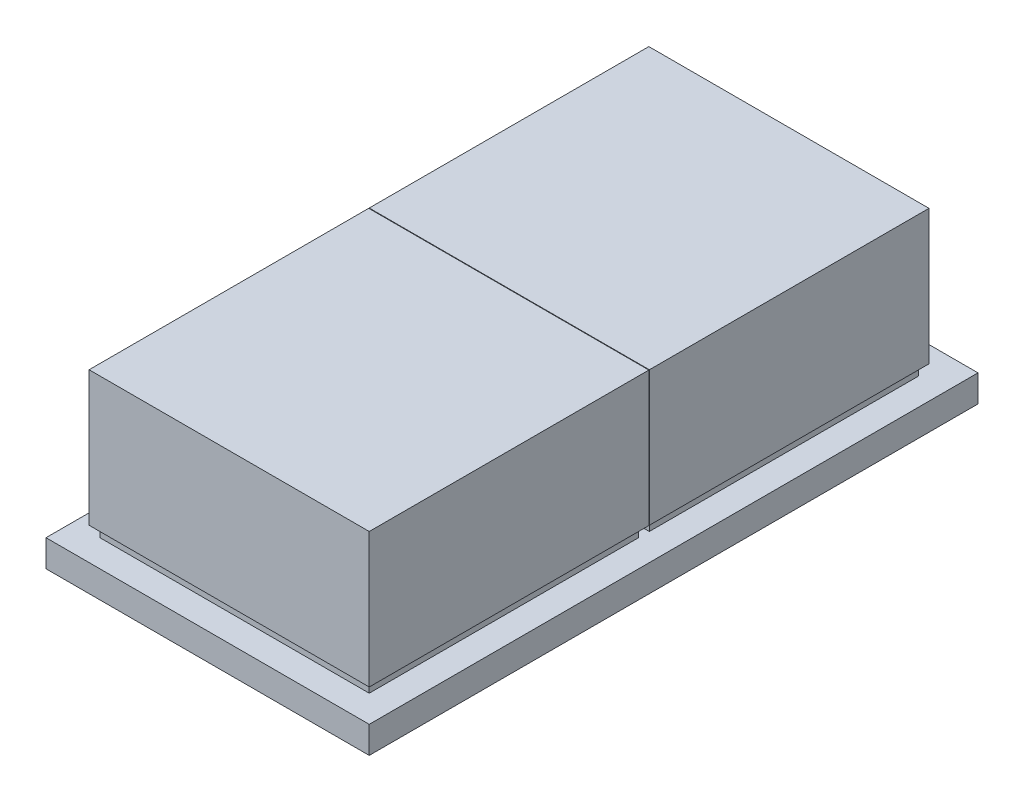
ISO-10303-21;
HEADER;
FILE_DESCRIPTION(('STEP AP214'),'2;1');
FILE_NAME('part.step','',(''),(''),'','','');
FILE_SCHEMA(('AUTOMOTIVE_DESIGN { 1 0 10303 214 1 1 1 1 }'));
ENDSEC;
DATA;
#1=APPLICATION_CONTEXT('core data for automotive mechanical design processes');
#2=APPLICATION_PROTOCOL_DEFINITION('international standard','automotive_design',2000,#1);
#3=PRODUCT_CONTEXT('',#1,'mechanical');
#4=PRODUCT('Part','Part','',(#3));
#5=PRODUCT_RELATED_PRODUCT_CATEGORY('part','',(#4));
#6=PRODUCT_DEFINITION_FORMATION('','',#4);
#7=PRODUCT_DEFINITION_CONTEXT('part definition',#1,'design');
#8=PRODUCT_DEFINITION('design','',#6,#7);
#9=PRODUCT_DEFINITION_SHAPE('','',#8);
#10=(LENGTH_UNIT() NAMED_UNIT(*) SI_UNIT(.MILLI.,.METRE.));
#11=(NAMED_UNIT(*) PLANE_ANGLE_UNIT() SI_UNIT($,.RADIAN.));
#12=(NAMED_UNIT(*) SI_UNIT($,.STERADIAN.) SOLID_ANGLE_UNIT());
#13=UNCERTAINTY_MEASURE_WITH_UNIT(LENGTH_MEASURE(1.E-05),#10,'distance_accuracy_value','');
#14=(GEOMETRIC_REPRESENTATION_CONTEXT(3) GLOBAL_UNCERTAINTY_ASSIGNED_CONTEXT((#13)) GLOBAL_UNIT_ASSIGNED_CONTEXT((#10,
#11,#12)) REPRESENTATION_CONTEXT('',''));
#15=CARTESIAN_POINT('',(0.,0.,0.));
#16=DIRECTION('',(0.,0.,1.));
#17=DIRECTION('',(1.,0.,0.));
#18=AXIS2_PLACEMENT_3D('',#15,#16,#17);
#19=CARTESIAN_POINT('',(0.,5.,0.));
#20=DIRECTION('',(0.,-1.,0.));
#21=DIRECTION('',(0.,0.,-1.));
#22=AXIS2_PLACEMENT_3D('',#19,#20,#21);
#23=PLANE('',#22);
#24=DIRECTION('',(0.,0.,-1.));
#25=VECTOR('',#24,1.);
#26=CARTESIAN_POINT('',(25.,5.,1.5));
#27=LINE('',#26,#25);
#28=CARTESIAN_POINT('',(25.,5.,51.5));
#29=VERTEX_POINT('',#28);
#30=CARTESIAN_POINT('',(25.,5.,1.5));
#31=VERTEX_POINT('',#30);
#32=EDGE_CURVE('E261',#29,#31,#27,.T.);
#33=ORIENTED_EDGE('',*,*,#32,.F.);
#34=DIRECTION('',(1.,0.,0.));
#35=VECTOR('',#34,1.);
#36=CARTESIAN_POINT('',(-25.,5.,51.5));
#37=LINE('',#36,#35);
#38=CARTESIAN_POINT('',(-25.,5.,51.5));
#39=VERTEX_POINT('',#38);
#40=EDGE_CURVE('E266',#39,#29,#37,.T.);
#41=ORIENTED_EDGE('',*,*,#40,.F.);
#42=DIRECTION('',(0.,0.,1.));
#43=VECTOR('',#42,1.);
#44=CARTESIAN_POINT('',(-25.,5.,1.5));
#45=LINE('',#44,#43);
#46=CARTESIAN_POINT('',(-25.,5.,1.5));
#47=VERTEX_POINT('',#46);
#48=EDGE_CURVE('E281',#47,#39,#45,.T.);
#49=ORIENTED_EDGE('',*,*,#48,.F.);
#50=DIRECTION('',(-1.,0.,0.));
#51=VECTOR('',#50,1.);
#52=CARTESIAN_POINT('',(-25.,5.,1.5));
#53=LINE('',#52,#51);
#54=EDGE_CURVE('E278',#31,#47,#53,.T.);
#55=ORIENTED_EDGE('',*,*,#54,.F.);
#56=EDGE_LOOP('',(#33,#41,#49,#55));
#57=FACE_BOUND('',#56,.T.);
#58=DIRECTION('',(0.,0.,-1.));
#59=VECTOR('',#58,1.);
#60=CARTESIAN_POINT('',(30.,5.,56.5));
#61=LINE('',#60,#59);
#62=CARTESIAN_POINT('',(30.,5.,56.5));
#63=VERTEX_POINT('',#62);
#64=CARTESIAN_POINT('',(30.,5.,-56.5));
#65=VERTEX_POINT('',#64);
#66=EDGE_CURVE('E298',#63,#65,#61,.T.);
#67=ORIENTED_EDGE('',*,*,#66,.T.);
#68=DIRECTION('',(-1.,0.,0.));
#69=VECTOR('',#68,1.);
#70=CARTESIAN_POINT('',(-30.,5.,-56.5));
#71=LINE('',#70,#69);
#72=CARTESIAN_POINT('',(-30.,5.,-56.5));
#73=VERTEX_POINT('',#72);
#74=EDGE_CURVE('E301',#65,#73,#71,.T.);
#75=ORIENTED_EDGE('',*,*,#74,.T.);
#76=DIRECTION('',(0.,0.,1.));
#77=VECTOR('',#76,1.);
#78=CARTESIAN_POINT('',(-30.,5.,56.5));
#79=LINE('',#78,#77);
#80=CARTESIAN_POINT('',(-30.,5.,56.5));
#81=VERTEX_POINT('',#80);
#82=EDGE_CURVE('E304',#73,#81,#79,.T.);
#83=ORIENTED_EDGE('',*,*,#82,.T.);
#84=DIRECTION('',(1.,0.,0.));
#85=VECTOR('',#84,1.);
#86=CARTESIAN_POINT('',(-30.,5.,56.5));
#87=LINE('',#86,#85);
#88=EDGE_CURVE('E306',#81,#63,#87,.T.);
#89=ORIENTED_EDGE('',*,*,#88,.T.);
#90=EDGE_LOOP('',(#67,#75,#83,#89));
#91=FACE_BOUND('',#90,.T.);
#92=DIRECTION('',(0.,0.,-1.));
#93=VECTOR('',#92,1.);
#94=CARTESIAN_POINT('',(25.,5.,-50.5));
#95=LINE('',#94,#93);
#96=CARTESIAN_POINT('',(25.,5.,-0.5));
#97=VERTEX_POINT('',#96);
#98=CARTESIAN_POINT('',(25.,5.,-50.5));
#99=VERTEX_POINT('',#98);
#100=EDGE_CURVE('E230',#97,#99,#95,.T.);
#101=ORIENTED_EDGE('',*,*,#100,.F.);
#102=DIRECTION('',(1.,0.,0.));
#103=VECTOR('',#102,1.);
#104=CARTESIAN_POINT('',(-25.,5.,-0.5));
#105=LINE('',#104,#103);
#106=CARTESIAN_POINT('',(-25.,5.,-0.5));
#107=VERTEX_POINT('',#106);
#108=EDGE_CURVE('E235',#107,#97,#105,.T.);
#109=ORIENTED_EDGE('',*,*,#108,.F.);
#110=DIRECTION('',(0.,0.,1.));
#111=VECTOR('',#110,1.);
#112=CARTESIAN_POINT('',(-25.,5.,-50.5));
#113=LINE('',#112,#111);
#114=CARTESIAN_POINT('',(-25.,5.,-50.5));
#115=VERTEX_POINT('',#114);
#116=EDGE_CURVE('E55',#115,#107,#113,.T.);
#117=ORIENTED_EDGE('',*,*,#116,.F.);
#118=DIRECTION('',(-1.,0.,0.));
#119=VECTOR('',#118,1.);
#120=CARTESIAN_POINT('',(-25.,5.,-50.5));
#121=LINE('',#120,#119);
#122=EDGE_CURVE('E50',#99,#115,#121,.T.);
#123=ORIENTED_EDGE('',*,*,#122,.F.);
#124=EDGE_LOOP('',(#101,#109,#117,#123));
#125=FACE_BOUND('',#124,.T.);
#126=ADVANCED_FACE('F35',(#57,#91,#125),#23,.F.);
#127=CARTESIAN_POINT('',(30.,5.,56.5));
#128=DIRECTION('',(-1.,0.,0.));
#129=DIRECTION('',(0.,0.,1.));
#130=AXIS2_PLACEMENT_3D('',#127,#128,#129);
#131=PLANE('',#130);
#132=DIRECTION('',(0.,0.,-1.));
#133=VECTOR('',#132,1.);
#134=CARTESIAN_POINT('',(30.,0.,56.5));
#135=LINE('',#134,#133);
#136=CARTESIAN_POINT('',(30.,0.,56.5));
#137=VERTEX_POINT('',#136);
#138=CARTESIAN_POINT('',(30.,0.,-56.5));
#139=VERTEX_POINT('',#138);
#140=EDGE_CURVE('E297',#137,#139,#135,.T.);
#141=ORIENTED_EDGE('',*,*,#140,.T.);
#142=DIRECTION('',(0.,-1.,0.));
#143=VECTOR('',#142,1.);
#144=CARTESIAN_POINT('',(30.,5.,-56.5));
#145=LINE('',#144,#143);
#146=EDGE_CURVE('E11',#65,#139,#145,.T.);
#147=ORIENTED_EDGE('',*,*,#146,.F.);
#148=ORIENTED_EDGE('',*,*,#66,.F.);
#149=DIRECTION('',(0.,-1.,0.));
#150=VECTOR('',#149,1.);
#151=CARTESIAN_POINT('',(30.,5.,56.5));
#152=LINE('',#151,#150);
#153=EDGE_CURVE('E308',#63,#137,#152,.T.);
#154=ORIENTED_EDGE('',*,*,#153,.T.);
#155=EDGE_LOOP('',(#141,#147,#148,#154));
#156=FACE_BOUND('',#155,.T.);
#157=ADVANCED_FACE('F37',(#156),#131,.F.);
#158=CARTESIAN_POINT('',(-30.,5.,-56.5));
#159=DIRECTION('',(0.,0.,1.));
#160=DIRECTION('',(1.,0.,0.));
#161=AXIS2_PLACEMENT_3D('',#158,#159,#160);
#162=PLANE('',#161);
#163=DIRECTION('',(-1.,0.,0.));
#164=VECTOR('',#163,1.);
#165=CARTESIAN_POINT('',(-30.,0.,-56.5));
#166=LINE('',#165,#164);
#167=CARTESIAN_POINT('',(-30.,0.,-56.5));
#168=VERTEX_POINT('',#167);
#169=EDGE_CURVE('E311',#139,#168,#166,.T.);
#170=ORIENTED_EDGE('',*,*,#169,.T.);
#171=DIRECTION('',(0.,-1.,0.));
#172=VECTOR('',#171,1.);
#173=CARTESIAN_POINT('',(-30.,5.,-56.5));
#174=LINE('',#173,#172);
#175=EDGE_CURVE('E43',#73,#168,#174,.T.);
#176=ORIENTED_EDGE('',*,*,#175,.F.);
#177=ORIENTED_EDGE('',*,*,#74,.F.);
#178=ORIENTED_EDGE('',*,*,#146,.T.);
#179=EDGE_LOOP('',(#170,#176,#177,#178));
#180=FACE_BOUND('',#179,.T.);
#181=ADVANCED_FACE('F340',(#180),#162,.F.);
#182=CARTESIAN_POINT('',(-30.,5.,56.5));
#183=DIRECTION('',(1.,0.,0.));
#184=DIRECTION('',(0.,0.,-1.));
#185=AXIS2_PLACEMENT_3D('',#182,#183,#184);
#186=PLANE('',#185);
#187=DIRECTION('',(0.,0.,1.));
#188=VECTOR('',#187,1.);
#189=CARTESIAN_POINT('',(-30.,0.,56.5));
#190=LINE('',#189,#188);
#191=CARTESIAN_POINT('',(-30.,0.,56.5));
#192=VERTEX_POINT('',#191);
#193=EDGE_CURVE('E313',#168,#192,#190,.T.);
#194=ORIENTED_EDGE('',*,*,#193,.T.);
#195=DIRECTION('',(0.,-1.,0.));
#196=VECTOR('',#195,1.);
#197=CARTESIAN_POINT('',(-30.,5.,56.5));
#198=LINE('',#197,#196);
#199=EDGE_CURVE('E318',#81,#192,#198,.T.);
#200=ORIENTED_EDGE('',*,*,#199,.F.);
#201=ORIENTED_EDGE('',*,*,#82,.F.);
#202=ORIENTED_EDGE('',*,*,#175,.T.);
#203=EDGE_LOOP('',(#194,#200,#201,#202));
#204=FACE_BOUND('',#203,.T.);
#205=ADVANCED_FACE('F325',(#204),#186,.F.);
#206=CARTESIAN_POINT('',(-30.,5.,56.5));
#207=DIRECTION('',(0.,0.,-1.));
#208=DIRECTION('',(-1.,0.,0.));
#209=AXIS2_PLACEMENT_3D('',#206,#207,#208);
#210=PLANE('',#209);
#211=DIRECTION('',(1.,0.,0.));
#212=VECTOR('',#211,1.);
#213=CARTESIAN_POINT('',(-30.,0.,56.5));
#214=LINE('',#213,#212);
#215=EDGE_CURVE('E302',#192,#137,#214,.T.);
#216=ORIENTED_EDGE('',*,*,#215,.T.);
#217=ORIENTED_EDGE('',*,*,#153,.F.);
#218=ORIENTED_EDGE('',*,*,#88,.F.);
#219=ORIENTED_EDGE('',*,*,#199,.T.);
#220=EDGE_LOOP('',(#216,#217,#218,#219));
#221=FACE_BOUND('',#220,.T.);
#222=ADVANCED_FACE('F334',(#221),#210,.F.);
#223=CARTESIAN_POINT('',(0.,0.,0.));
#224=DIRECTION('',(0.,-1.,0.));
#225=DIRECTION('',(0.,0.,-1.));
#226=AXIS2_PLACEMENT_3D('',#223,#224,#225);
#227=PLANE('',#226);
#228=ORIENTED_EDGE('',*,*,#140,.F.);
#229=ORIENTED_EDGE('',*,*,#215,.F.);
#230=ORIENTED_EDGE('',*,*,#193,.F.);
#231=ORIENTED_EDGE('',*,*,#169,.F.);
#232=EDGE_LOOP('',(#228,#229,#230,#231));
#233=FACE_BOUND('',#232,.T.);
#234=ADVANCED_FACE('F331',(#233),#227,.T.);
#235=CARTESIAN_POINT('',(25.,7.,1.5));
#236=DIRECTION('',(-1.,0.,0.));
#237=DIRECTION('',(0.,0.,1.));
#238=AXIS2_PLACEMENT_3D('',#235,#236,#237);
#239=PLANE('',#238);
#240=ORIENTED_EDGE('',*,*,#32,.T.);
#241=DIRECTION('',(0.,-1.,0.));
#242=VECTOR('',#241,1.);
#243=CARTESIAN_POINT('',(25.,7.,1.5));
#244=LINE('',#243,#242);
#245=CARTESIAN_POINT('',(25.,7.,1.5));
#246=VERTEX_POINT('',#245);
#247=EDGE_CURVE('E294',#246,#31,#244,.T.);
#248=ORIENTED_EDGE('',*,*,#247,.F.);
#249=DIRECTION('',(0.,0.,-1.));
#250=VECTOR('',#249,1.);
#251=CARTESIAN_POINT('',(25.,7.,1.5));
#252=LINE('',#251,#250);
#253=CARTESIAN_POINT('',(25.,7.,51.5));
#254=VERTEX_POINT('',#253);
#255=EDGE_CURVE('E262',#254,#246,#252,.T.);
#256=ORIENTED_EDGE('',*,*,#255,.F.);
#257=DIRECTION('',(0.,-1.,0.));
#258=VECTOR('',#257,1.);
#259=CARTESIAN_POINT('',(25.,7.,51.5));
#260=LINE('',#259,#258);
#261=EDGE_CURVE('E275',#254,#29,#260,.T.);
#262=ORIENTED_EDGE('',*,*,#261,.T.);
#263=EDGE_LOOP('',(#240,#248,#256,#262));
#264=FACE_BOUND('',#263,.T.);
#265=ADVANCED_FACE('F354',(#264),#239,.F.);
#266=CARTESIAN_POINT('',(-25.,7.,1.5));
#267=DIRECTION('',(0.,0.,1.));
#268=DIRECTION('',(1.,0.,0.));
#269=AXIS2_PLACEMENT_3D('',#266,#267,#268);
#270=PLANE('',#269);
#271=ORIENTED_EDGE('',*,*,#54,.T.);
#272=DIRECTION('',(0.,-1.,0.));
#273=VECTOR('',#272,1.);
#274=CARTESIAN_POINT('',(-25.,7.,1.5));
#275=LINE('',#274,#273);
#276=CARTESIAN_POINT('',(-25.,7.,1.5));
#277=VERTEX_POINT('',#276);
#278=EDGE_CURVE('E291',#277,#47,#275,.T.);
#279=ORIENTED_EDGE('',*,*,#278,.F.);
#280=DIRECTION('',(-1.,0.,0.));
#281=VECTOR('',#280,1.);
#282=CARTESIAN_POINT('',(-25.,7.,1.5));
#283=LINE('',#282,#281);
#284=EDGE_CURVE('E265',#246,#277,#283,.T.);
#285=ORIENTED_EDGE('',*,*,#284,.F.);
#286=ORIENTED_EDGE('',*,*,#247,.T.);
#287=EDGE_LOOP('',(#271,#279,#285,#286));
#288=FACE_BOUND('',#287,.T.);
#289=ADVANCED_FACE('F373',(#288),#270,.F.);
#290=CARTESIAN_POINT('',(-25.,7.,1.5));
#291=DIRECTION('',(1.,0.,0.));
#292=DIRECTION('',(0.,0.,-1.));
#293=AXIS2_PLACEMENT_3D('',#290,#291,#292);
#294=PLANE('',#293);
#295=ORIENTED_EDGE('',*,*,#48,.T.);
#296=DIRECTION('',(0.,-1.,0.));
#297=VECTOR('',#296,1.);
#298=CARTESIAN_POINT('',(-25.,7.,51.5));
#299=LINE('',#298,#297);
#300=CARTESIAN_POINT('',(-25.,7.,51.5));
#301=VERTEX_POINT('',#300);
#302=EDGE_CURVE('E288',#301,#39,#299,.T.);
#303=ORIENTED_EDGE('',*,*,#302,.F.);
#304=DIRECTION('',(0.,0.,1.));
#305=VECTOR('',#304,1.);
#306=CARTESIAN_POINT('',(-25.,7.,1.5));
#307=LINE('',#306,#305);
#308=EDGE_CURVE('E269',#277,#301,#307,.T.);
#309=ORIENTED_EDGE('',*,*,#308,.F.);
#310=ORIENTED_EDGE('',*,*,#278,.T.);
#311=EDGE_LOOP('',(#295,#303,#309,#310));
#312=FACE_BOUND('',#311,.T.);
#313=ADVANCED_FACE('F380',(#312),#294,.F.);
#314=CARTESIAN_POINT('',(-25.,7.,51.5));
#315=DIRECTION('',(0.,0.,-1.));
#316=DIRECTION('',(-1.,0.,0.));
#317=AXIS2_PLACEMENT_3D('',#314,#315,#316);
#318=PLANE('',#317);
#319=ORIENTED_EDGE('',*,*,#40,.T.);
#320=ORIENTED_EDGE('',*,*,#261,.F.);
#321=DIRECTION('',(1.,0.,0.));
#322=VECTOR('',#321,1.);
#323=CARTESIAN_POINT('',(-25.,7.,51.5));
#324=LINE('',#323,#322);
#325=EDGE_CURVE('E272',#301,#254,#324,.T.);
#326=ORIENTED_EDGE('',*,*,#325,.F.);
#327=ORIENTED_EDGE('',*,*,#302,.T.);
#328=EDGE_LOOP('',(#319,#320,#326,#327));
#329=FACE_BOUND('',#328,.T.);
#330=ADVANCED_FACE('F387',(#329),#318,.F.);
#331=CARTESIAN_POINT('',(25.,7.,-50.5));
#332=DIRECTION('',(-1.,0.,0.));
#333=DIRECTION('',(0.,0.,1.));
#334=AXIS2_PLACEMENT_3D('',#331,#332,#333);
#335=PLANE('',#334);
#336=ORIENTED_EDGE('',*,*,#100,.T.);
#337=DIRECTION('',(0.,-1.,0.));
#338=VECTOR('',#337,1.);
#339=CARTESIAN_POINT('',(25.,7.,-50.5));
#340=LINE('',#339,#338);
#341=CARTESIAN_POINT('',(25.,7.,-50.5));
#342=VERTEX_POINT('',#341);
#343=EDGE_CURVE('E259',#342,#99,#340,.T.);
#344=ORIENTED_EDGE('',*,*,#343,.F.);
#345=DIRECTION('',(0.,0.,-1.));
#346=VECTOR('',#345,1.);
#347=CARTESIAN_POINT('',(25.,7.,-50.5));
#348=LINE('',#347,#346);
#349=CARTESIAN_POINT('',(25.,7.,-0.5));
#350=VERTEX_POINT('',#349);
#351=EDGE_CURVE('E231',#350,#342,#348,.T.);
#352=ORIENTED_EDGE('',*,*,#351,.F.);
#353=DIRECTION('',(0.,-1.,0.));
#354=VECTOR('',#353,1.);
#355=CARTESIAN_POINT('',(25.,7.,-0.5));
#356=LINE('',#355,#354);
#357=EDGE_CURVE('E244',#350,#97,#356,.T.);
#358=ORIENTED_EDGE('',*,*,#357,.T.);
#359=EDGE_LOOP('',(#336,#344,#352,#358));
#360=FACE_BOUND('',#359,.T.);
#361=ADVANCED_FACE('F395',(#360),#335,.F.);
#362=CARTESIAN_POINT('',(-25.,7.,-50.5));
#363=DIRECTION('',(0.,0.,1.));
#364=DIRECTION('',(1.,0.,0.));
#365=AXIS2_PLACEMENT_3D('',#362,#363,#364);
#366=PLANE('',#365);
#367=ORIENTED_EDGE('',*,*,#122,.T.);
#368=DIRECTION('',(0.,-1.,0.));
#369=VECTOR('',#368,1.);
#370=CARTESIAN_POINT('',(-25.,7.,-50.5));
#371=LINE('',#370,#369);
#372=CARTESIAN_POINT('',(-25.,7.,-50.5));
#373=VERTEX_POINT('',#372);
#374=EDGE_CURVE('E256',#373,#115,#371,.T.);
#375=ORIENTED_EDGE('',*,*,#374,.F.);
#376=DIRECTION('',(-1.,0.,0.));
#377=VECTOR('',#376,1.);
#378=CARTESIAN_POINT('',(-25.,7.,-50.5));
#379=LINE('',#378,#377);
#380=EDGE_CURVE('E234',#342,#373,#379,.T.);
#381=ORIENTED_EDGE('',*,*,#380,.F.);
#382=ORIENTED_EDGE('',*,*,#343,.T.);
#383=EDGE_LOOP('',(#367,#375,#381,#382));
#384=FACE_BOUND('',#383,.T.);
#385=ADVANCED_FACE('F404',(#384),#366,.F.);
#386=CARTESIAN_POINT('',(-25.,7.,-50.5));
#387=DIRECTION('',(1.,0.,0.));
#388=DIRECTION('',(0.,0.,-1.));
#389=AXIS2_PLACEMENT_3D('',#386,#387,#388);
#390=PLANE('',#389);
#391=ORIENTED_EDGE('',*,*,#116,.T.);
#392=DIRECTION('',(0.,-1.,0.));
#393=VECTOR('',#392,1.);
#394=CARTESIAN_POINT('',(-25.,7.,-0.5));
#395=LINE('',#394,#393);
#396=CARTESIAN_POINT('',(-25.,7.,-0.5));
#397=VERTEX_POINT('',#396);
#398=EDGE_CURVE('E253',#397,#107,#395,.T.);
#399=ORIENTED_EDGE('',*,*,#398,.F.);
#400=DIRECTION('',(0.,0.,1.));
#401=VECTOR('',#400,1.);
#402=CARTESIAN_POINT('',(-25.,7.,-50.5));
#403=LINE('',#402,#401);
#404=EDGE_CURVE('E238',#373,#397,#403,.T.);
#405=ORIENTED_EDGE('',*,*,#404,.F.);
#406=ORIENTED_EDGE('',*,*,#374,.T.);
#407=EDGE_LOOP('',(#391,#399,#405,#406));
#408=FACE_BOUND('',#407,.T.);
#409=ADVANCED_FACE('F414',(#408),#390,.F.);
#410=CARTESIAN_POINT('',(-25.,7.,-0.5));
#411=DIRECTION('',(0.,0.,-1.));
#412=DIRECTION('',(-1.,0.,0.));
#413=AXIS2_PLACEMENT_3D('',#410,#411,#412);
#414=PLANE('',#413);
#415=ORIENTED_EDGE('',*,*,#108,.T.);
#416=ORIENTED_EDGE('',*,*,#357,.F.);
#417=DIRECTION('',(1.,0.,0.));
#418=VECTOR('',#417,1.);
#419=CARTESIAN_POINT('',(-25.,7.,-0.5));
#420=LINE('',#419,#418);
#421=EDGE_CURVE('E241',#397,#350,#420,.T.);
#422=ORIENTED_EDGE('',*,*,#421,.F.);
#423=ORIENTED_EDGE('',*,*,#398,.T.);
#424=EDGE_LOOP('',(#415,#416,#422,#423));
#425=FACE_BOUND('',#424,.T.);
#426=ADVANCED_FACE('F423',(#425),#414,.F.);
#427=CARTESIAN_POINT('',(0.,7.,0.));
#428=DIRECTION('',(0.,1.,0.));
#429=DIRECTION('',(0.,0.,1.));
#430=AXIS2_PLACEMENT_3D('',#427,#428,#429);
#431=PLANE('',#430);
#432=DIRECTION('',(0.,0.,-1.));
#433=VECTOR('',#432,1.);
#434=CARTESIAN_POINT('',(26.,7.,0.600000000000003));
#435=LINE('',#434,#433);
#436=CARTESIAN_POINT('',(26.,7.,52.5));
#437=VERTEX_POINT('',#436);
#438=CARTESIAN_POINT('',(26.,7.,0.600000000000003));
#439=VERTEX_POINT('',#438);
#440=EDGE_CURVE('E195',#437,#439,#435,.T.);
#441=ORIENTED_EDGE('',*,*,#440,.F.);
#442=DIRECTION('',(1.,0.,0.));
#443=VECTOR('',#442,1.);
#444=CARTESIAN_POINT('',(-26.,7.,52.5));
#445=LINE('',#444,#443);
#446=CARTESIAN_POINT('',(-26.,7.,52.5));
#447=VERTEX_POINT('',#446);
#448=EDGE_CURVE('E208',#447,#437,#445,.T.);
#449=ORIENTED_EDGE('',*,*,#448,.F.);
#450=DIRECTION('',(0.,0.,1.));
#451=VECTOR('',#450,1.);
#452=CARTESIAN_POINT('',(-26.,7.,0.600000000000003));
#453=LINE('',#452,#451);
#454=CARTESIAN_POINT('',(-26.,7.,0.600000000000003));
#455=VERTEX_POINT('',#454);
#456=EDGE_CURVE('E216',#455,#447,#453,.T.);
#457=ORIENTED_EDGE('',*,*,#456,.F.);
#458=DIRECTION('',(-1.,0.,0.));
#459=VECTOR('',#458,1.);
#460=CARTESIAN_POINT('',(-26.,7.,0.600000000000003));
#461=LINE('',#460,#459);
#462=EDGE_CURVE('E198',#439,#455,#461,.T.);
#463=ORIENTED_EDGE('',*,*,#462,.F.);
#464=EDGE_LOOP('',(#441,#449,#457,#463));
#465=FACE_BOUND('',#464,.T.);
#466=ORIENTED_EDGE('',*,*,#325,.T.);
#467=ORIENTED_EDGE('',*,*,#255,.T.);
#468=ORIENTED_EDGE('',*,*,#284,.T.);
#469=ORIENTED_EDGE('',*,*,#308,.T.);
#470=EDGE_LOOP('',(#466,#467,#468,#469));
#471=FACE_BOUND('',#470,.T.);
#472=ADVANCED_FACE('F432',(#465,#471),#431,.F.);
#473=CARTESIAN_POINT('',(26.,32.,0.600000000000003));
#474=DIRECTION('',(-1.,0.,0.));
#475=DIRECTION('',(0.,0.,1.));
#476=AXIS2_PLACEMENT_3D('',#473,#474,#475);
#477=PLANE('',#476);
#478=ORIENTED_EDGE('',*,*,#440,.T.);
#479=DIRECTION('',(0.,-1.,0.));
#480=VECTOR('',#479,1.);
#481=CARTESIAN_POINT('',(26.,32.,0.600000000000003));
#482=LINE('',#481,#480);
#483=CARTESIAN_POINT('',(26.,32.,0.600000000000003));
#484=VERTEX_POINT('',#483);
#485=EDGE_CURVE('E227',#484,#439,#482,.T.);
#486=ORIENTED_EDGE('',*,*,#485,.F.);
#487=DIRECTION('',(0.,0.,-1.));
#488=VECTOR('',#487,1.);
#489=CARTESIAN_POINT('',(26.,32.,0.600000000000003));
#490=LINE('',#489,#488);
#491=CARTESIAN_POINT('',(26.,32.,52.5));
#492=VERTEX_POINT('',#491);
#493=EDGE_CURVE('E204',#492,#484,#490,.T.);
#494=ORIENTED_EDGE('',*,*,#493,.F.);
#495=DIRECTION('',(0.,-1.,0.));
#496=VECTOR('',#495,1.);
#497=CARTESIAN_POINT('',(26.,32.,52.5));
#498=LINE('',#497,#496);
#499=EDGE_CURVE('E213',#492,#437,#498,.T.);
#500=ORIENTED_EDGE('',*,*,#499,.T.);
#501=EDGE_LOOP('',(#478,#486,#494,#500));
#502=FACE_BOUND('',#501,.T.);
#503=ADVANCED_FACE('F441',(#502),#477,.F.);
#504=CARTESIAN_POINT('',(-26.,32.,0.600000000000003));
#505=DIRECTION('',(0.,0.,1.));
#506=DIRECTION('',(1.,0.,0.));
#507=AXIS2_PLACEMENT_3D('',#504,#505,#506);
#508=PLANE('',#507);
#509=ORIENTED_EDGE('',*,*,#462,.T.);
#510=DIRECTION('',(0.,-1.,0.));
#511=VECTOR('',#510,1.);
#512=CARTESIAN_POINT('',(-26.,32.,0.600000000000003));
#513=LINE('',#512,#511);
#514=CARTESIAN_POINT('',(-26.,32.,0.600000000000003));
#515=VERTEX_POINT('',#514);
#516=EDGE_CURVE('E224',#515,#455,#513,.T.);
#517=ORIENTED_EDGE('',*,*,#516,.F.);
#518=DIRECTION('',(-1.,0.,0.));
#519=VECTOR('',#518,1.);
#520=CARTESIAN_POINT('',(-26.,32.,0.600000000000003));
#521=LINE('',#520,#519);
#522=EDGE_CURVE('E207',#484,#515,#521,.T.);
#523=ORIENTED_EDGE('',*,*,#522,.F.);
#524=ORIENTED_EDGE('',*,*,#485,.T.);
#525=EDGE_LOOP('',(#509,#517,#523,#524));
#526=FACE_BOUND('',#525,.T.);
#527=ADVANCED_FACE('F449',(#526),#508,.F.);
#528=CARTESIAN_POINT('',(-26.,32.,0.600000000000003));
#529=DIRECTION('',(1.,0.,0.));
#530=DIRECTION('',(0.,0.,-1.));
#531=AXIS2_PLACEMENT_3D('',#528,#529,#530);
#532=PLANE('',#531);
#533=ORIENTED_EDGE('',*,*,#456,.T.);
#534=DIRECTION('',(0.,-1.,0.));
#535=VECTOR('',#534,1.);
#536=CARTESIAN_POINT('',(-26.,32.,52.5));
#537=LINE('',#536,#535);
#538=CARTESIAN_POINT('',(-26.,32.,52.5));
#539=VERTEX_POINT('',#538);
#540=EDGE_CURVE('E221',#539,#447,#537,.T.);
#541=ORIENTED_EDGE('',*,*,#540,.F.);
#542=DIRECTION('',(0.,0.,1.));
#543=VECTOR('',#542,1.);
#544=CARTESIAN_POINT('',(-26.,32.,0.600000000000003));
#545=LINE('',#544,#543);
#546=EDGE_CURVE('E210',#515,#539,#545,.T.);
#547=ORIENTED_EDGE('',*,*,#546,.F.);
#548=ORIENTED_EDGE('',*,*,#516,.T.);
#549=EDGE_LOOP('',(#533,#541,#547,#548));
#550=FACE_BOUND('',#549,.T.);
#551=ADVANCED_FACE('F457',(#550),#532,.F.);
#552=CARTESIAN_POINT('',(-26.,32.,52.5));
#553=DIRECTION('',(0.,0.,-1.));
#554=DIRECTION('',(-1.,0.,0.));
#555=AXIS2_PLACEMENT_3D('',#552,#553,#554);
#556=PLANE('',#555);
#557=ORIENTED_EDGE('',*,*,#448,.T.);
#558=ORIENTED_EDGE('',*,*,#499,.F.);
#559=DIRECTION('',(1.,0.,0.));
#560=VECTOR('',#559,1.);
#561=CARTESIAN_POINT('',(-26.,32.,52.5));
#562=LINE('',#561,#560);
#563=EDGE_CURVE('E212',#539,#492,#562,.T.);
#564=ORIENTED_EDGE('',*,*,#563,.F.);
#565=ORIENTED_EDGE('',*,*,#540,.T.);
#566=EDGE_LOOP('',(#557,#558,#564,#565));
#567=FACE_BOUND('',#566,.T.);
#568=ADVANCED_FACE('F465',(#567),#556,.F.);
#569=CARTESIAN_POINT('',(0.,32.,0.));
#570=DIRECTION('',(0.,1.,0.));
#571=DIRECTION('',(0.,0.,1.));
#572=AXIS2_PLACEMENT_3D('',#569,#570,#571);
#573=PLANE('',#572);
#574=ORIENTED_EDGE('',*,*,#493,.T.);
#575=ORIENTED_EDGE('',*,*,#522,.T.);
#576=ORIENTED_EDGE('',*,*,#546,.T.);
#577=ORIENTED_EDGE('',*,*,#563,.T.);
#578=EDGE_LOOP('',(#574,#575,#576,#577));
#579=FACE_BOUND('',#578,.T.);
#580=ADVANCED_FACE('F473',(#579),#573,.T.);
#581=CARTESIAN_POINT('',(0.,7.,-52.));
#582=DIRECTION('',(0.,1.,0.));
#583=DIRECTION('',(0.,0.,1.));
#584=AXIS2_PLACEMENT_3D('',#581,#582,#583);
#585=PLANE('',#584);
#586=DIRECTION('',(0.,0.,-1.));
#587=VECTOR('',#586,1.);
#588=CARTESIAN_POINT('',(26.,7.,-51.4));
#589=LINE('',#588,#587);
#590=CARTESIAN_POINT('',(26.,7.,0.5));
#591=VERTEX_POINT('',#590);
#592=CARTESIAN_POINT('',(26.,7.,-51.4));
#593=VERTEX_POINT('',#592);
#594=EDGE_CURVE('E194',#591,#593,#589,.T.);
#595=ORIENTED_EDGE('',*,*,#594,.F.);
#596=DIRECTION('',(1.,0.,0.));
#597=VECTOR('',#596,1.);
#598=CARTESIAN_POINT('',(-26.,7.,0.5));
#599=LINE('',#598,#597);
#600=CARTESIAN_POINT('',(-26.,7.,0.5));
#601=VERTEX_POINT('',#600);
#602=EDGE_CURVE('E190',#601,#591,#599,.T.);
#603=ORIENTED_EDGE('',*,*,#602,.F.);
#604=DIRECTION('',(0.,0.,1.));
#605=VECTOR('',#604,1.);
#606=CARTESIAN_POINT('',(-26.,7.,-51.4));
#607=LINE('',#606,#605);
#608=CARTESIAN_POINT('',(-26.,7.,-51.4));
#609=VERTEX_POINT('',#608);
#610=EDGE_CURVE('E608',#609,#601,#607,.T.);
#611=ORIENTED_EDGE('',*,*,#610,.F.);
#612=DIRECTION('',(-1.,0.,0.));
#613=VECTOR('',#612,1.);
#614=CARTESIAN_POINT('',(-26.,7.,-51.4));
#615=LINE('',#614,#613);
#616=EDGE_CURVE('E612',#593,#609,#615,.T.);
#617=ORIENTED_EDGE('',*,*,#616,.F.);
#618=EDGE_LOOP('',(#595,#603,#611,#617));
#619=FACE_BOUND('',#618,.T.);
#620=ORIENTED_EDGE('',*,*,#421,.T.);
#621=ORIENTED_EDGE('',*,*,#351,.T.);
#622=ORIENTED_EDGE('',*,*,#380,.T.);
#623=ORIENTED_EDGE('',*,*,#404,.T.);
#624=EDGE_LOOP('',(#620,#621,#622,#623));
#625=FACE_BOUND('',#624,.T.);
#626=ADVANCED_FACE('F481',(#619,#625),#585,.F.);
#627=CARTESIAN_POINT('',(26.,32.,-51.4));
#628=DIRECTION('',(-1.,0.,0.));
#629=DIRECTION('',(0.,0.,1.));
#630=AXIS2_PLACEMENT_3D('',#627,#628,#629);
#631=PLANE('',#630);
#632=ORIENTED_EDGE('',*,*,#594,.T.);
#633=DIRECTION('',(0.,-1.,0.));
#634=VECTOR('',#633,1.);
#635=CARTESIAN_POINT('',(26.,32.,-51.4));
#636=LINE('',#635,#634);
#637=CARTESIAN_POINT('',(26.,32.,-51.4));
#638=VERTEX_POINT('',#637);
#639=EDGE_CURVE('E174',#638,#593,#636,.T.);
#640=ORIENTED_EDGE('',*,*,#639,.F.);
#641=DIRECTION('',(0.,0.,-1.));
#642=VECTOR('',#641,1.);
#643=CARTESIAN_POINT('',(26.,32.,-51.4));
#644=LINE('',#643,#642);
#645=CARTESIAN_POINT('',(26.,32.,0.5));
#646=VERTEX_POINT('',#645);
#647=EDGE_CURVE('E181',#646,#638,#644,.T.);
#648=ORIENTED_EDGE('',*,*,#647,.F.);
#649=DIRECTION('',(0.,-1.,0.));
#650=VECTOR('',#649,1.);
#651=CARTESIAN_POINT('',(26.,32.,0.5));
#652=LINE('',#651,#650);
#653=EDGE_CURVE('E605',#646,#591,#652,.T.);
#654=ORIENTED_EDGE('',*,*,#653,.T.);
#655=EDGE_LOOP('',(#632,#640,#648,#654));
#656=FACE_BOUND('',#655,.T.);
#657=ADVANCED_FACE('F192',(#656),#631,.F.);
#658=CARTESIAN_POINT('',(-26.,32.,-51.4));
#659=DIRECTION('',(0.,0.,1.));
#660=DIRECTION('',(1.,0.,0.));
#661=AXIS2_PLACEMENT_3D('',#658,#659,#660);
#662=PLANE('',#661);
#663=ORIENTED_EDGE('',*,*,#616,.T.);
#664=DIRECTION('',(0.,-1.,0.));
#665=VECTOR('',#664,1.);
#666=CARTESIAN_POINT('',(-26.,32.,-51.4));
#667=LINE('',#666,#665);
#668=CARTESIAN_POINT('',(-26.,32.,-51.4));
#669=VERTEX_POINT('',#668);
#670=EDGE_CURVE('E177',#669,#609,#667,.T.);
#671=ORIENTED_EDGE('',*,*,#670,.F.);
#672=DIRECTION('',(-1.,0.,0.));
#673=VECTOR('',#672,1.);
#674=CARTESIAN_POINT('',(-26.,32.,-51.4));
#675=LINE('',#674,#673);
#676=EDGE_CURVE('E170',#638,#669,#675,.T.);
#677=ORIENTED_EDGE('',*,*,#676,.F.);
#678=ORIENTED_EDGE('',*,*,#639,.T.);
#679=EDGE_LOOP('',(#663,#671,#677,#678));
#680=FACE_BOUND('',#679,.T.);
#681=ADVANCED_FACE('F172',(#680),#662,.F.);
#682=CARTESIAN_POINT('',(-26.,32.,-51.4));
#683=DIRECTION('',(1.,0.,0.));
#684=DIRECTION('',(0.,0.,-1.));
#685=AXIS2_PLACEMENT_3D('',#682,#683,#684);
#686=PLANE('',#685);
#687=ORIENTED_EDGE('',*,*,#610,.T.);
#688=DIRECTION('',(0.,-1.,0.));
#689=VECTOR('',#688,1.);
#690=CARTESIAN_POINT('',(-26.,32.,0.5));
#691=LINE('',#690,#689);
#692=CARTESIAN_POINT('',(-26.,32.,0.5));
#693=VERTEX_POINT('',#692);
#694=EDGE_CURVE('E200',#693,#601,#691,.T.);
#695=ORIENTED_EDGE('',*,*,#694,.F.);
#696=DIRECTION('',(0.,0.,1.));
#697=VECTOR('',#696,1.);
#698=CARTESIAN_POINT('',(-26.,32.,-51.4));
#699=LINE('',#698,#697);
#700=EDGE_CURVE('E180',#669,#693,#699,.T.);
#701=ORIENTED_EDGE('',*,*,#700,.F.);
#702=ORIENTED_EDGE('',*,*,#670,.T.);
#703=EDGE_LOOP('',(#687,#695,#701,#702));
#704=FACE_BOUND('',#703,.T.);
#705=ADVANCED_FACE('F500',(#704),#686,.F.);
#706=CARTESIAN_POINT('',(-26.,32.,0.5));
#707=DIRECTION('',(0.,0.,-1.));
#708=DIRECTION('',(-1.,0.,0.));
#709=AXIS2_PLACEMENT_3D('',#706,#707,#708);
#710=PLANE('',#709);
#711=ORIENTED_EDGE('',*,*,#602,.T.);
#712=ORIENTED_EDGE('',*,*,#653,.F.);
#713=DIRECTION('',(1.,0.,0.));
#714=VECTOR('',#713,1.);
#715=CARTESIAN_POINT('',(-26.,32.,0.5));
#716=LINE('',#715,#714);
#717=EDGE_CURVE('E186',#693,#646,#716,.T.);
#718=ORIENTED_EDGE('',*,*,#717,.F.);
#719=ORIENTED_EDGE('',*,*,#694,.T.);
#720=EDGE_LOOP('',(#711,#712,#718,#719));
#721=FACE_BOUND('',#720,.T.);
#722=ADVANCED_FACE('F506',(#721),#710,.F.);
#723=CARTESIAN_POINT('',(0.,32.,-52.));
#724=DIRECTION('',(0.,1.,0.));
#725=DIRECTION('',(0.,0.,1.));
#726=AXIS2_PLACEMENT_3D('',#723,#724,#725);
#727=PLANE('',#726);
#728=ORIENTED_EDGE('',*,*,#647,.T.);
#729=ORIENTED_EDGE('',*,*,#676,.T.);
#730=ORIENTED_EDGE('',*,*,#700,.T.);
#731=ORIENTED_EDGE('',*,*,#717,.T.);
#732=EDGE_LOOP('',(#728,#729,#730,#731));
#733=FACE_BOUND('',#732,.T.);
#734=ADVANCED_FACE('F184',(#733),#727,.T.);
#735=CLOSED_SHELL('',(#126,#157,#181,#205,#222,#234,#265,#289,#313,#330,#361,#385,#409,#426,
#472,#503,#527,#551,#568,#580,#626,#657,#681,#705,#722,#734));
#736=MANIFOLD_SOLID_BREP('B2',#735);
#737=ADVANCED_BREP_SHAPE_REPRESENTATION('',(#18,#736),#14);
#738=SHAPE_DEFINITION_REPRESENTATION(#9,#737);
ENDSEC;
END-ISO-10303-21;
